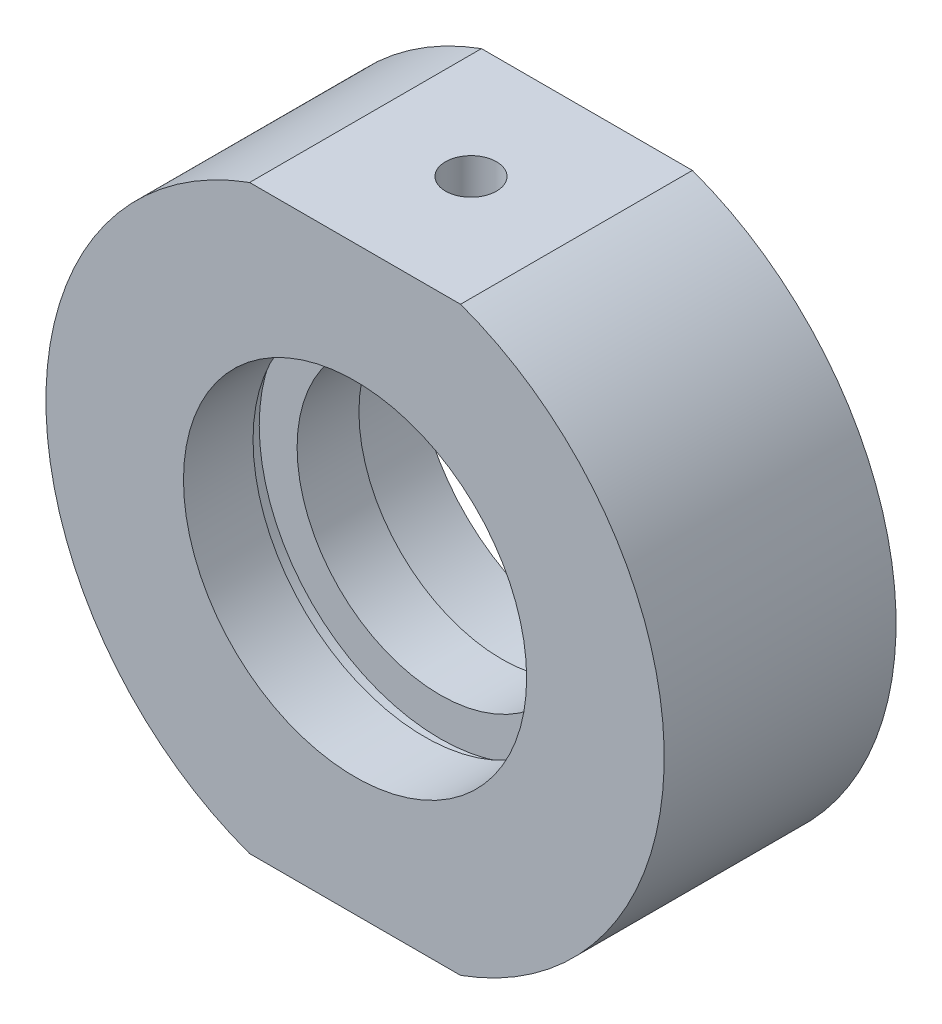
ISO-10303-21;
HEADER;
FILE_DESCRIPTION(('STEP AP214'),'2;1');
FILE_NAME('part.step','',(''),(''),'','','');
FILE_SCHEMA(('AUTOMOTIVE_DESIGN { 1 0 10303 214 1 1 1 1 }'));
ENDSEC;
DATA;
#1=APPLICATION_CONTEXT('core data for automotive mechanical design processes');
#2=APPLICATION_PROTOCOL_DEFINITION('international standard','automotive_design',2000,#1);
#3=PRODUCT_CONTEXT('',#1,'mechanical');
#4=PRODUCT('Part','Part','',(#3));
#5=PRODUCT_RELATED_PRODUCT_CATEGORY('part','',(#4));
#6=PRODUCT_DEFINITION_FORMATION('','',#4);
#7=PRODUCT_DEFINITION_CONTEXT('part definition',#1,'design');
#8=PRODUCT_DEFINITION('design','',#6,#7);
#9=PRODUCT_DEFINITION_SHAPE('','',#8);
#10=(LENGTH_UNIT() NAMED_UNIT(*) SI_UNIT(.MILLI.,.METRE.));
#11=(NAMED_UNIT(*) PLANE_ANGLE_UNIT() SI_UNIT($,.RADIAN.));
#12=(NAMED_UNIT(*) SI_UNIT($,.STERADIAN.) SOLID_ANGLE_UNIT());
#13=UNCERTAINTY_MEASURE_WITH_UNIT(LENGTH_MEASURE(1.E-05),#10,'distance_accuracy_value','');
#14=(GEOMETRIC_REPRESENTATION_CONTEXT(3) GLOBAL_UNCERTAINTY_ASSIGNED_CONTEXT((#13)) GLOBAL_UNIT_ASSIGNED_CONTEXT((#10,
#11,#12)) REPRESENTATION_CONTEXT('',''));
#15=CARTESIAN_POINT('',(0.,0.,0.));
#16=DIRECTION('',(0.,0.,1.));
#17=DIRECTION('',(1.,0.,0.));
#18=AXIS2_PLACEMENT_3D('',#15,#16,#17);
#19=CARTESIAN_POINT('',(0.,0.,-31.9390681003584));
#20=DIRECTION('',(0.,0.,-1.));
#21=DIRECTION('',(-1.,0.,0.));
#22=AXIS2_PLACEMENT_3D('',#19,#20,#21);
#23=CYLINDRICAL_SURFACE('',#22,20.);
#24=CARTESIAN_POINT('',(0.,0.,7.49999999999999));
#25=DIRECTION('',(0.,0.,-1.));
#26=DIRECTION('',(-1.,0.,0.));
#27=AXIS2_PLACEMENT_3D('',#24,#25,#26);
#28=CIRCLE('',#27,20.);
#29=CARTESIAN_POINT('',(6.8234888436928,18.8,7.5));
#30=VERTEX_POINT('',#29);
#31=CARTESIAN_POINT('',(6.8234888436928,-18.8,7.5));
#32=VERTEX_POINT('',#31);
#33=EDGE_CURVE('E150',#30,#32,#28,.T.);
#34=ORIENTED_EDGE('',*,*,#33,.T.);
#35=DIRECTION('',(0.,0.,-1.));
#36=VECTOR('',#35,1.);
#37=CARTESIAN_POINT('',(6.82348884369281,-18.8,-31.9390681003584));
#38=LINE('',#37,#36);
#39=CARTESIAN_POINT('',(6.8234888436928,-18.8,-7.5));
#40=VERTEX_POINT('',#39);
#41=EDGE_CURVE('E116',#32,#40,#38,.T.);
#42=ORIENTED_EDGE('',*,*,#41,.T.);
#43=CARTESIAN_POINT('',(0.,0.,-7.5));
#44=DIRECTION('',(0.,0.,-1.));
#45=DIRECTION('',(-1.,0.,0.));
#46=AXIS2_PLACEMENT_3D('',#43,#44,#45);
#47=CIRCLE('',#46,20.);
#48=CARTESIAN_POINT('',(6.8234888436928,18.8,-7.5));
#49=VERTEX_POINT('',#48);
#50=EDGE_CURVE('E145',#49,#40,#47,.T.);
#51=ORIENTED_EDGE('',*,*,#50,.F.);
#52=DIRECTION('',(0.,0.,-1.));
#53=VECTOR('',#52,1.);
#54=CARTESIAN_POINT('',(6.82348884369281,18.8,-31.9390681003584));
#55=LINE('',#54,#53);
#56=EDGE_CURVE('E61',#49,#30,#55,.F.);
#57=ORIENTED_EDGE('',*,*,#56,.T.);
#58=EDGE_LOOP('',(#34,#42,#51,#57));
#59=FACE_BOUND('',#58,.T.);
#60=ADVANCED_FACE('F38',(#59),#23,.T.);
#61=CARTESIAN_POINT('',(9.25,0.,-2.));
#62=DIRECTION('',(0.,0.,1.));
#63=DIRECTION('',(1.,0.,0.));
#64=AXIS2_PLACEMENT_3D('',#61,#62,#63);
#65=PLANE('',#64);
#66=CARTESIAN_POINT('',(0.,0.,-2.));
#67=DIRECTION('',(0.,0.,-1.));
#68=DIRECTION('',(-1.,0.,0.));
#69=AXIS2_PLACEMENT_3D('',#66,#67,#68);
#70=CIRCLE('',#69,9.25);
#71=CARTESIAN_POINT('',(-9.25,0.,-2.));
#72=VERTEX_POINT('',#71);
#73=EDGE_CURVE('E174',#72,#72,#70,.T.);
#74=ORIENTED_EDGE('',*,*,#73,.F.);
#75=EDGE_LOOP('',(#74));
#76=FACE_BOUND('',#75,.T.);
#77=CARTESIAN_POINT('',(0.,0.,-2.00000000000001));
#78=DIRECTION('',(0.,0.,-1.));
#79=DIRECTION('',(-1.,0.,0.));
#80=AXIS2_PLACEMENT_3D('',#77,#78,#79);
#81=CIRCLE('',#80,11.7);
#82=CARTESIAN_POINT('',(-11.7,0.,-2.));
#83=VERTEX_POINT('',#82);
#84=EDGE_CURVE('E129',#83,#83,#81,.T.);
#85=ORIENTED_EDGE('',*,*,#84,.T.);
#86=EDGE_LOOP('',(#85));
#87=FACE_BOUND('',#86,.T.);
#88=ADVANCED_FACE('F40',(#76,#87),#65,.F.);
#89=CARTESIAN_POINT('',(0.,0.,-31.9390681003584));
#90=DIRECTION('',(0.,0.,-1.));
#91=DIRECTION('',(-1.,0.,0.));
#92=AXIS2_PLACEMENT_3D('',#89,#90,#91);
#93=CYLINDRICAL_SURFACE('',#92,9.25);
#94=CARTESIAN_POINT('',(0.,0.,1.99999999999999));
#95=DIRECTION('',(0.,0.,-1.));
#96=DIRECTION('',(-1.,0.,0.));
#97=AXIS2_PLACEMENT_3D('',#94,#95,#96);
#98=CIRCLE('',#97,9.25);
#99=CARTESIAN_POINT('',(-9.25,0.,2.));
#100=VERTEX_POINT('',#99);
#101=EDGE_CURVE('E170',#100,#100,#98,.T.);
#102=ORIENTED_EDGE('',*,*,#101,.F.);
#103=EDGE_LOOP('',(#102));
#104=FACE_BOUND('',#103,.T.);
#105=ORIENTED_EDGE('',*,*,#73,.T.);
#106=EDGE_LOOP('',(#105));
#107=FACE_BOUND('',#106,.T.);
#108=ADVANCED_FACE('F214',(#104,#107),#93,.F.);
#109=CARTESIAN_POINT('',(11.7,0.,2.));
#110=DIRECTION('',(0.,0.,-1.));
#111=DIRECTION('',(-1.,0.,0.));
#112=AXIS2_PLACEMENT_3D('',#109,#110,#111);
#113=PLANE('',#112);
#114=CARTESIAN_POINT('',(0.,0.,1.99999999999999));
#115=DIRECTION('',(0.,0.,-1.));
#116=DIRECTION('',(-1.,0.,0.));
#117=AXIS2_PLACEMENT_3D('',#114,#115,#116);
#118=CIRCLE('',#117,11.7);
#119=CARTESIAN_POINT('',(-11.7,0.,2.));
#120=VERTEX_POINT('',#119);
#121=EDGE_CURVE('E166',#120,#120,#118,.T.);
#122=ORIENTED_EDGE('',*,*,#121,.F.);
#123=EDGE_LOOP('',(#122));
#124=FACE_BOUND('',#123,.T.);
#125=ORIENTED_EDGE('',*,*,#101,.T.);
#126=EDGE_LOOP('',(#125));
#127=FACE_BOUND('',#126,.T.);
#128=ADVANCED_FACE('F237',(#124,#127),#113,.F.);
#129=CARTESIAN_POINT('',(0.,0.,-31.9390681003584));
#130=DIRECTION('',(0.,0.,-1.));
#131=DIRECTION('',(-1.,0.,0.));
#132=AXIS2_PLACEMENT_3D('',#129,#130,#131);
#133=CYLINDRICAL_SURFACE('',#132,11.7);
#134=CARTESIAN_POINT('',(0.,0.,3.));
#135=DIRECTION('',(0.,0.,-1.));
#136=DIRECTION('',(-1.,0.,0.));
#137=AXIS2_PLACEMENT_3D('',#134,#135,#136);
#138=CIRCLE('',#137,11.7);
#139=CARTESIAN_POINT('',(-11.7,0.,3.));
#140=VERTEX_POINT('',#139);
#141=EDGE_CURVE('E162',#140,#140,#138,.T.);
#142=ORIENTED_EDGE('',*,*,#141,.F.);
#143=EDGE_LOOP('',(#142));
#144=FACE_BOUND('',#143,.T.);
#145=ORIENTED_EDGE('',*,*,#121,.T.);
#146=EDGE_LOOP('',(#145));
#147=FACE_BOUND('',#146,.T.);
#148=ADVANCED_FACE('F233',(#144,#147),#133,.F.);
#149=CARTESIAN_POINT('',(11.7,0.,3.));
#150=DIRECTION('',(0.,0.,1.));
#151=DIRECTION('',(1.,0.,0.));
#152=AXIS2_PLACEMENT_3D('',#149,#150,#151);
#153=PLANE('',#152);
#154=CARTESIAN_POINT('',(0.,0.,3.));
#155=DIRECTION('',(0.,0.,-1.));
#156=DIRECTION('',(-1.,0.,0.));
#157=AXIS2_PLACEMENT_3D('',#154,#155,#156);
#158=CIRCLE('',#157,11.1);
#159=CARTESIAN_POINT('',(-11.1,0.,3.));
#160=VERTEX_POINT('',#159);
#161=EDGE_CURVE('E158',#160,#160,#158,.T.);
#162=ORIENTED_EDGE('',*,*,#161,.F.);
#163=EDGE_LOOP('',(#162));
#164=FACE_BOUND('',#163,.T.);
#165=ORIENTED_EDGE('',*,*,#141,.T.);
#166=EDGE_LOOP('',(#165));
#167=FACE_BOUND('',#166,.T.);
#168=ADVANCED_FACE('F227',(#164,#167),#153,.F.);
#169=CARTESIAN_POINT('',(0.,0.,-31.9390681003584));
#170=DIRECTION('',(0.,0.,-1.));
#171=DIRECTION('',(-1.,0.,0.));
#172=AXIS2_PLACEMENT_3D('',#169,#170,#171);
#173=CYLINDRICAL_SURFACE('',#172,11.1);
#174=CARTESIAN_POINT('',(0.,0.,7.5));
#175=DIRECTION('',(0.,0.,-1.));
#176=DIRECTION('',(-1.,0.,0.));
#177=AXIS2_PLACEMENT_3D('',#174,#175,#176);
#178=CIRCLE('',#177,11.1);
#179=CARTESIAN_POINT('',(-11.1,0.,7.5));
#180=VERTEX_POINT('',#179);
#181=EDGE_CURVE('E154',#180,#180,#178,.T.);
#182=ORIENTED_EDGE('',*,*,#181,.F.);
#183=EDGE_LOOP('',(#182));
#184=FACE_BOUND('',#183,.T.);
#185=ORIENTED_EDGE('',*,*,#161,.T.);
#186=EDGE_LOOP('',(#185));
#187=FACE_BOUND('',#186,.T.);
#188=ADVANCED_FACE('F224',(#184,#187),#173,.F.);
#189=CARTESIAN_POINT('',(20.,0.,7.5));
#190=DIRECTION('',(0.,0.,-1.));
#191=DIRECTION('',(-1.,0.,0.));
#192=AXIS2_PLACEMENT_3D('',#189,#190,#191);
#193=PLANE('',#192);
#194=CARTESIAN_POINT('',(-6.82348884369279,-18.8,7.5));
#195=VERTEX_POINT('',#194);
#196=CARTESIAN_POINT('',(-6.82348884369279,18.8,7.5));
#197=VERTEX_POINT('',#196);
#198=EDGE_CURVE('E149',#195,#197,#28,.T.);
#199=ORIENTED_EDGE('',*,*,#198,.F.);
#200=DIRECTION('',(-1.,0.,0.));
#201=VECTOR('',#200,1.);
#202=CARTESIAN_POINT('',(-33.1519726534682,-18.8,7.5));
#203=LINE('',#202,#201);
#204=EDGE_CURVE('E111',#32,#195,#203,.T.);
#205=ORIENTED_EDGE('',*,*,#204,.F.);
#206=ORIENTED_EDGE('',*,*,#33,.F.);
#207=DIRECTION('',(1.,0.,0.));
#208=VECTOR('',#207,1.);
#209=CARTESIAN_POINT('',(-33.1519726534682,18.8,7.5));
#210=LINE('',#209,#208);
#211=EDGE_CURVE('E120',#197,#30,#210,.T.);
#212=ORIENTED_EDGE('',*,*,#211,.F.);
#213=EDGE_LOOP('',(#199,#205,#206,#212));
#214=FACE_BOUND('',#213,.T.);
#215=ORIENTED_EDGE('',*,*,#181,.T.);
#216=EDGE_LOOP('',(#215));
#217=FACE_BOUND('',#216,.T.);
#218=ADVANCED_FACE('F189',(#214,#217),#193,.F.);
#219=CARTESIAN_POINT('',(-6.82348884369279,-18.8,-7.5));
#220=VERTEX_POINT('',#219);
#221=CARTESIAN_POINT('',(-6.82348884369279,18.8,-7.5));
#222=VERTEX_POINT('',#221);
#223=EDGE_CURVE('E144',#220,#222,#47,.T.);
#224=ORIENTED_EDGE('',*,*,#223,.F.);
#225=DIRECTION('',(0.,0.,-1.));
#226=VECTOR('',#225,1.);
#227=CARTESIAN_POINT('',(-6.82348884369281,-18.8,-31.9390681003584));
#228=LINE('',#227,#226);
#229=EDGE_CURVE('E54',#220,#195,#228,.F.);
#230=ORIENTED_EDGE('',*,*,#229,.T.);
#231=ORIENTED_EDGE('',*,*,#198,.T.);
#232=DIRECTION('',(0.,0.,-1.));
#233=VECTOR('',#232,1.);
#234=CARTESIAN_POINT('',(-6.82348884369281,18.8,-31.9390681003584));
#235=LINE('',#234,#233);
#236=EDGE_CURVE('E125',#197,#222,#235,.T.);
#237=ORIENTED_EDGE('',*,*,#236,.T.);
#238=EDGE_LOOP('',(#224,#230,#231,#237));
#239=FACE_BOUND('',#238,.T.);
#240=ADVANCED_FACE('F194',(#239),#23,.T.);
#241=CARTESIAN_POINT('',(11.1,0.,-7.5));
#242=DIRECTION('',(0.,0.,1.));
#243=DIRECTION('',(1.,0.,0.));
#244=AXIS2_PLACEMENT_3D('',#241,#242,#243);
#245=PLANE('',#244);
#246=CARTESIAN_POINT('',(0.,0.,-7.50000000000001));
#247=DIRECTION('',(0.,0.,-1.));
#248=DIRECTION('',(-1.,0.,0.));
#249=AXIS2_PLACEMENT_3D('',#246,#247,#248);
#250=CIRCLE('',#249,11.1);
#251=CARTESIAN_POINT('',(-11.1,0.,-7.50000000000001));
#252=VERTEX_POINT('',#251);
#253=EDGE_CURVE('E140',#252,#252,#250,.T.);
#254=ORIENTED_EDGE('',*,*,#253,.F.);
#255=EDGE_LOOP('',(#254));
#256=FACE_BOUND('',#255,.T.);
#257=ORIENTED_EDGE('',*,*,#50,.T.);
#258=DIRECTION('',(-1.,0.,0.));
#259=VECTOR('',#258,1.);
#260=CARTESIAN_POINT('',(11.1,-18.8,-7.5));
#261=LINE('',#260,#259);
#262=EDGE_CURVE('E11',#40,#220,#261,.T.);
#263=ORIENTED_EDGE('',*,*,#262,.T.);
#264=ORIENTED_EDGE('',*,*,#223,.T.);
#265=DIRECTION('',(1.,0.,0.));
#266=VECTOR('',#265,1.);
#267=CARTESIAN_POINT('',(11.1,18.8,-7.5));
#268=LINE('',#267,#266);
#269=EDGE_CURVE('E47',#222,#49,#268,.T.);
#270=ORIENTED_EDGE('',*,*,#269,.T.);
#271=EDGE_LOOP('',(#257,#263,#264,#270));
#272=FACE_BOUND('',#271,.T.);
#273=ADVANCED_FACE('F180',(#256,#272),#245,.F.);
#274=CARTESIAN_POINT('',(0.,0.,-31.9390681003584));
#275=DIRECTION('',(0.,0.,-1.));
#276=DIRECTION('',(-1.,0.,0.));
#277=AXIS2_PLACEMENT_3D('',#274,#275,#276);
#278=CYLINDRICAL_SURFACE('',#277,11.1);
#279=CARTESIAN_POINT('',(0.,0.,-3.));
#280=DIRECTION('',(0.,0.,-1.));
#281=DIRECTION('',(-1.,0.,0.));
#282=AXIS2_PLACEMENT_3D('',#279,#280,#281);
#283=CIRCLE('',#282,11.1);
#284=CARTESIAN_POINT('',(-11.1,0.,-3.));
#285=VERTEX_POINT('',#284);
#286=EDGE_CURVE('E136',#285,#285,#283,.T.);
#287=ORIENTED_EDGE('',*,*,#286,.F.);
#288=EDGE_LOOP('',(#287));
#289=FACE_BOUND('',#288,.T.);
#290=ORIENTED_EDGE('',*,*,#253,.T.);
#291=EDGE_LOOP('',(#290));
#292=FACE_BOUND('',#291,.T.);
#293=ADVANCED_FACE('F222',(#289,#292),#278,.F.);
#294=CARTESIAN_POINT('',(11.7,0.,-3.));
#295=DIRECTION('',(0.,0.,-1.));
#296=DIRECTION('',(-1.,0.,0.));
#297=AXIS2_PLACEMENT_3D('',#294,#295,#296);
#298=PLANE('',#297);
#299=CARTESIAN_POINT('',(0.,0.,-3.));
#300=DIRECTION('',(0.,0.,-1.));
#301=DIRECTION('',(-1.,0.,0.));
#302=AXIS2_PLACEMENT_3D('',#299,#300,#301);
#303=CIRCLE('',#302,11.7);
#304=CARTESIAN_POINT('',(-11.7,0.,-3.));
#305=VERTEX_POINT('',#304);
#306=EDGE_CURVE('E132',#305,#305,#303,.T.);
#307=ORIENTED_EDGE('',*,*,#306,.F.);
#308=EDGE_LOOP('',(#307));
#309=FACE_BOUND('',#308,.T.);
#310=ORIENTED_EDGE('',*,*,#286,.T.);
#311=EDGE_LOOP('',(#310));
#312=FACE_BOUND('',#311,.T.);
#313=ADVANCED_FACE('F206',(#309,#312),#298,.F.);
#314=CARTESIAN_POINT('',(0.,0.,-31.9390681003584));
#315=DIRECTION('',(0.,0.,-1.));
#316=DIRECTION('',(-1.,0.,0.));
#317=AXIS2_PLACEMENT_3D('',#314,#315,#316);
#318=CYLINDRICAL_SURFACE('',#317,11.7);
#319=ORIENTED_EDGE('',*,*,#84,.F.);
#320=EDGE_LOOP('',(#319));
#321=FACE_BOUND('',#320,.T.);
#322=ORIENTED_EDGE('',*,*,#306,.T.);
#323=EDGE_LOOP('',(#322));
#324=FACE_BOUND('',#323,.T.);
#325=ADVANCED_FACE('F197',(#321,#324),#318,.F.);
#326=CARTESIAN_POINT('',(-33.1519726534682,18.8,-41.5));
#327=DIRECTION('',(0.,-1.,0.));
#328=DIRECTION('',(0.,0.,-1.));
#329=AXIS2_PLACEMENT_3D('',#326,#327,#328);
#330=PLANE('',#329);
#331=CARTESIAN_POINT('',(0.,18.8,0.));
#332=DIRECTION('',(0.,1.,0.));
#333=DIRECTION('',(0.,0.,1.));
#334=AXIS2_PLACEMENT_3D('',#331,#332,#333);
#335=CIRCLE('',#334,1.64999999999999);
#336=CARTESIAN_POINT('',(0.,18.8,1.64999999999999));
#337=VERTEX_POINT('',#336);
#338=EDGE_CURVE('E95',#337,#337,#335,.T.);
#339=ORIENTED_EDGE('',*,*,#338,.F.);
#340=EDGE_LOOP('',(#339));
#341=FACE_BOUND('',#340,.T.);
#342=ORIENTED_EDGE('',*,*,#211,.T.);
#343=ORIENTED_EDGE('',*,*,#56,.F.);
#344=ORIENTED_EDGE('',*,*,#269,.F.);
#345=ORIENTED_EDGE('',*,*,#236,.F.);
#346=EDGE_LOOP('',(#342,#343,#344,#345));
#347=FACE_BOUND('',#346,.T.);
#348=ADVANCED_FACE('F195',(#341,#347),#330,.F.);
#349=CARTESIAN_POINT('',(-33.1519726534682,-18.8,-41.5));
#350=DIRECTION('',(0.,1.,0.));
#351=DIRECTION('',(0.,0.,1.));
#352=AXIS2_PLACEMENT_3D('',#349,#350,#351);
#353=PLANE('',#352);
#354=CARTESIAN_POINT('',(0.,-18.8,0.));
#355=DIRECTION('',(0.,-1.,0.));
#356=DIRECTION('',(0.,0.,-1.));
#357=AXIS2_PLACEMENT_3D('',#354,#355,#356);
#358=CIRCLE('',#357,2.5);
#359=CARTESIAN_POINT('',(0.,-18.8,-2.5));
#360=VERTEX_POINT('',#359);
#361=EDGE_CURVE('E96',#360,#360,#358,.T.);
#362=ORIENTED_EDGE('',*,*,#361,.F.);
#363=EDGE_LOOP('',(#362));
#364=FACE_BOUND('',#363,.T.);
#365=ORIENTED_EDGE('',*,*,#204,.T.);
#366=ORIENTED_EDGE('',*,*,#229,.F.);
#367=ORIENTED_EDGE('',*,*,#262,.F.);
#368=ORIENTED_EDGE('',*,*,#41,.F.);
#369=EDGE_LOOP('',(#365,#366,#367,#368));
#370=FACE_BOUND('',#369,.T.);
#371=ADVANCED_FACE('F186',(#364,#370),#353,.F.);
#372=CARTESIAN_POINT('',(0.,13.3,0.));
#373=DIRECTION('',(0.,1.,0.));
#374=DIRECTION('',(0.,0.,1.));
#375=AXIS2_PLACEMENT_3D('',#372,#373,#374);
#376=CONICAL_SURFACE('',#375,1.65,1.02974425867665);
#377=CARTESIAN_POINT('',(0.,12.3085799786045,0.));
#378=VERTEX_POINT('',#377);
#379=VERTEX_LOOP('',#378);
#380=FACE_BOUND('',#379,.T.);
#381=CARTESIAN_POINT('',(0.,13.3,0.));
#382=DIRECTION('',(0.,1.,0.));
#383=DIRECTION('',(0.,0.,1.));
#384=AXIS2_PLACEMENT_3D('',#381,#382,#383);
#385=CIRCLE('',#384,1.65);
#386=CARTESIAN_POINT('',(0.,13.3,1.65));
#387=VERTEX_POINT('',#386);
#388=EDGE_CURVE('E102',#387,#387,#385,.T.);
#389=ORIENTED_EDGE('',*,*,#388,.T.);
#390=EDGE_LOOP('',(#389));
#391=FACE_BOUND('',#390,.T.);
#392=ADVANCED_FACE('F203',(#380,#391),#376,.F.);
#393=CARTESIAN_POINT('',(0.,18.8,0.));
#394=DIRECTION('',(0.,1.,0.));
#395=DIRECTION('',(0.,0.,1.));
#396=AXIS2_PLACEMENT_3D('',#393,#394,#395);
#397=CYLINDRICAL_SURFACE('',#396,1.64999999999999);
#398=ORIENTED_EDGE('',*,*,#388,.F.);
#399=EDGE_LOOP('',(#398));
#400=FACE_BOUND('',#399,.T.);
#401=ORIENTED_EDGE('',*,*,#338,.T.);
#402=EDGE_LOOP('',(#401));
#403=FACE_BOUND('',#402,.T.);
#404=ADVANCED_FACE('F88',(#400,#403),#397,.F.);
#405=CARTESIAN_POINT('',(0.,-13.3,0.));
#406=DIRECTION('',(0.,-1.,0.));
#407=DIRECTION('',(0.,0.,-1.));
#408=AXIS2_PLACEMENT_3D('',#405,#406,#407);
#409=CONICAL_SURFACE('',#408,2.5,1.02974425867665);
#410=CARTESIAN_POINT('',(0.,-11.7978484524311,0.));
#411=VERTEX_POINT('',#410);
#412=VERTEX_LOOP('',#411);
#413=FACE_BOUND('',#412,.T.);
#414=CARTESIAN_POINT('',(0.,-13.3,0.));
#415=DIRECTION('',(0.,-1.,0.));
#416=DIRECTION('',(0.,0.,-1.));
#417=AXIS2_PLACEMENT_3D('',#414,#415,#416);
#418=CIRCLE('',#417,2.5);
#419=CARTESIAN_POINT('',(0.,-13.3,-2.5));
#420=VERTEX_POINT('',#419);
#421=EDGE_CURVE('E92',#420,#420,#418,.T.);
#422=ORIENTED_EDGE('',*,*,#421,.T.);
#423=EDGE_LOOP('',(#422));
#424=FACE_BOUND('',#423,.T.);
#425=ADVANCED_FACE('F84',(#413,#424),#409,.F.);
#426=CARTESIAN_POINT('',(0.,-18.8,0.));
#427=DIRECTION('',(0.,-1.,0.));
#428=DIRECTION('',(0.,0.,-1.));
#429=AXIS2_PLACEMENT_3D('',#426,#427,#428);
#430=CYLINDRICAL_SURFACE('',#429,2.5);
#431=ORIENTED_EDGE('',*,*,#421,.F.);
#432=EDGE_LOOP('',(#431));
#433=FACE_BOUND('',#432,.T.);
#434=ORIENTED_EDGE('',*,*,#361,.T.);
#435=EDGE_LOOP('',(#434));
#436=FACE_BOUND('',#435,.T.);
#437=ADVANCED_FACE('F87',(#433,#436),#430,.F.);
#438=CLOSED_SHELL('',(#60,#88,#108,#128,#148,#168,#188,#218,#240,#273,#293,#313,#325,#348,#371,
#392,#404,#425,#437));
#439=MANIFOLD_SOLID_BREP('B2',#438);
#440=ADVANCED_BREP_SHAPE_REPRESENTATION('',(#18,#439),#14);
#441=SHAPE_DEFINITION_REPRESENTATION(#9,#440);
ENDSEC;
END-ISO-10303-21;
